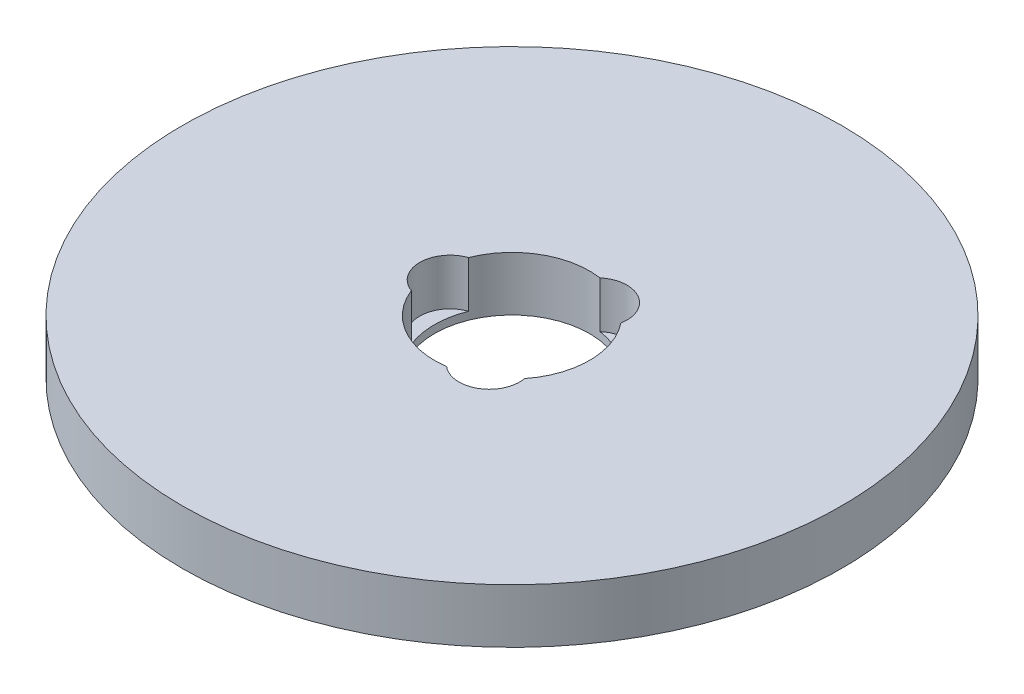
ISO-10303-21;
HEADER;
FILE_DESCRIPTION(('STEP AP214'),'2;1');
FILE_NAME('part.step','',(''),(''),'','','');
FILE_SCHEMA(('AUTOMOTIVE_DESIGN { 1 0 10303 214 1 1 1 1 }'));
ENDSEC;
DATA;
#1=APPLICATION_CONTEXT('core data for automotive mechanical design processes');
#2=APPLICATION_PROTOCOL_DEFINITION('international standard','automotive_design',2000,#1);
#3=PRODUCT_CONTEXT('',#1,'mechanical');
#4=PRODUCT('Part','Part','',(#3));
#5=PRODUCT_RELATED_PRODUCT_CATEGORY('part','',(#4));
#6=PRODUCT_DEFINITION_FORMATION('','',#4);
#7=PRODUCT_DEFINITION_CONTEXT('part definition',#1,'design');
#8=PRODUCT_DEFINITION('design','',#6,#7);
#9=PRODUCT_DEFINITION_SHAPE('','',#8);
#10=(LENGTH_UNIT() NAMED_UNIT(*) SI_UNIT(.MILLI.,.METRE.));
#11=(NAMED_UNIT(*) PLANE_ANGLE_UNIT() SI_UNIT($,.RADIAN.));
#12=(NAMED_UNIT(*) SI_UNIT($,.STERADIAN.) SOLID_ANGLE_UNIT());
#13=UNCERTAINTY_MEASURE_WITH_UNIT(LENGTH_MEASURE(1.E-05),#10,'distance_accuracy_value','');
#14=(GEOMETRIC_REPRESENTATION_CONTEXT(3) GLOBAL_UNCERTAINTY_ASSIGNED_CONTEXT((#13)) GLOBAL_UNIT_ASSIGNED_CONTEXT((#10,
#11,#12)) REPRESENTATION_CONTEXT('',''));
#15=CARTESIAN_POINT('',(0.,0.,0.));
#16=DIRECTION('',(0.,0.,1.));
#17=DIRECTION('',(1.,0.,0.));
#18=AXIS2_PLACEMENT_3D('',#15,#16,#17);
#19=CARTESIAN_POINT('',(0.,7.,0.));
#20=DIRECTION('',(0.,-1.,0.));
#21=DIRECTION('',(0.,0.,-1.));
#22=AXIS2_PLACEMENT_3D('',#19,#20,#21);
#23=CYLINDRICAL_SURFACE('',#22,42.5);
#24=CARTESIAN_POINT('',(0.,7.,0.));
#25=DIRECTION('',(0.,1.,0.));
#26=DIRECTION('',(0.,0.,1.));
#27=AXIS2_PLACEMENT_3D('',#24,#25,#26);
#28=CIRCLE('',#27,42.5);
#29=CARTESIAN_POINT('',(0.,7.,42.5));
#30=VERTEX_POINT('',#29);
#31=EDGE_CURVE('E130',#30,#30,#28,.T.);
#32=ORIENTED_EDGE('',*,*,#31,.F.);
#33=EDGE_LOOP('',(#32));
#34=FACE_BOUND('',#33,.T.);
#35=CARTESIAN_POINT('',(0.,0.,0.));
#36=DIRECTION('',(0.,1.,0.));
#37=DIRECTION('',(0.,0.,1.));
#38=AXIS2_PLACEMENT_3D('',#35,#36,#37);
#39=CIRCLE('',#38,42.5);
#40=CARTESIAN_POINT('',(0.,0.,42.5));
#41=VERTEX_POINT('',#40);
#42=EDGE_CURVE('E117',#41,#41,#39,.T.);
#43=ORIENTED_EDGE('',*,*,#42,.T.);
#44=EDGE_LOOP('',(#43));
#45=FACE_BOUND('',#44,.T.);
#46=ADVANCED_FACE('F39',(#34,#45),#23,.T.);
#47=CARTESIAN_POINT('',(0.,7.,0.));
#48=DIRECTION('',(0.,1.,0.));
#49=DIRECTION('',(0.,0.,1.));
#50=AXIS2_PLACEMENT_3D('',#47,#48,#49);
#51=PLANE('',#50);
#52=CARTESIAN_POINT('',(3.99436601122093,7.,6.9184448754608));
#53=DIRECTION('',(0.,1.,0.));
#54=DIRECTION('',(0.866025403784436,0.,-0.500000000000004));
#55=AXIS2_PLACEMENT_3D('',#52,#53,#54);
#56=CIRCLE('',#55,3.91149778572883);
#57=CARTESIAN_POINT('',(1.4550014765448,7.,9.89358229880625));
#58=VERTEX_POINT('',#57);
#59=CARTESIAN_POINT('',(7.84059286692592,7.,6.20685939063472));
#60=VERTEX_POINT('',#59);
#61=EDGE_CURVE('E148',#58,#60,#56,.T.);
#62=ORIENTED_EDGE('',*,*,#61,.F.);
#63=CARTESIAN_POINT('',(0.,7.,0.));
#64=DIRECTION('',(0.,1.,0.));
#65=DIRECTION('',(0.,0.,1.));
#66=AXIS2_PLACEMENT_3D('',#63,#64,#65);
#67=CIRCLE('',#66,10.);
#68=CARTESIAN_POINT('',(-9.29559434347064,7.,3.68672290817151));
#69=VERTEX_POINT('',#68);
#70=EDGE_CURVE('E113',#69,#58,#67,.T.);
#71=ORIENTED_EDGE('',*,*,#70,.F.);
#72=CARTESIAN_POINT('',(-7.98873202244179,7.,0.));
#73=DIRECTION('',(0.,1.,0.));
#74=DIRECTION('',(0.,0.,1.));
#75=AXIS2_PLACEMENT_3D('',#72,#73,#74);
#76=CIRCLE('',#75,3.91149778572883);
#77=CARTESIAN_POINT('',(-9.29559434347064,7.,-3.68672290817151));
#78=VERTEX_POINT('',#77);
#79=EDGE_CURVE('E125',#78,#69,#76,.T.);
#80=ORIENTED_EDGE('',*,*,#79,.F.);
#81=CARTESIAN_POINT('',(1.45500147654466,7.,-9.89358229880627));
#82=VERTEX_POINT('',#81);
#83=EDGE_CURVE('E107',#82,#78,#67,.T.);
#84=ORIENTED_EDGE('',*,*,#83,.F.);
#85=CARTESIAN_POINT('',(3.99436601122083,7.,-6.91844487546086));
#86=DIRECTION('',(0.,1.,0.));
#87=DIRECTION('',(-0.866025403784443,0.,-0.499999999999992));
#88=AXIS2_PLACEMENT_3D('',#85,#86,#87);
#89=CIRCLE('',#88,3.91149778572883);
#90=CARTESIAN_POINT('',(7.84059286692584,7.,-6.20685939063482));
#91=VERTEX_POINT('',#90);
#92=EDGE_CURVE('E95',#91,#82,#89,.T.);
#93=ORIENTED_EDGE('',*,*,#92,.F.);
#94=EDGE_CURVE('E106',#60,#91,#67,.T.);
#95=ORIENTED_EDGE('',*,*,#94,.F.);
#96=EDGE_LOOP('',(#62,#71,#80,#84,#93,#95));
#97=FACE_BOUND('',#96,.T.);
#98=ORIENTED_EDGE('',*,*,#31,.T.);
#99=EDGE_LOOP('',(#98));
#100=FACE_BOUND('',#99,.T.);
#101=ADVANCED_FACE('F102',(#97,#100),#51,.T.);
#102=CARTESIAN_POINT('',(0.,0.,0.));
#103=DIRECTION('',(0.,1.,0.));
#104=DIRECTION('',(0.,0.,1.));
#105=AXIS2_PLACEMENT_3D('',#102,#103,#104);
#106=PLANE('',#105);
#107=CARTESIAN_POINT('',(0.,0.,0.));
#108=DIRECTION('',(0.,1.,0.));
#109=DIRECTION('',(0.,0.,1.));
#110=AXIS2_PLACEMENT_3D('',#107,#108,#109);
#111=CIRCLE('',#110,10.);
#112=CARTESIAN_POINT('',(0.,0.,10.));
#113=VERTEX_POINT('',#112);
#114=EDGE_CURVE('E118',#113,#113,#111,.T.);
#115=ORIENTED_EDGE('',*,*,#114,.T.);
#116=EDGE_LOOP('',(#115));
#117=FACE_BOUND('',#116,.T.);
#118=ORIENTED_EDGE('',*,*,#42,.F.);
#119=EDGE_LOOP('',(#118));
#120=FACE_BOUND('',#119,.T.);
#121=ADVANCED_FACE('F161',(#117,#120),#106,.F.);
#122=CARTESIAN_POINT('',(0.,7.,0.));
#123=DIRECTION('',(0.,-1.,0.));
#124=DIRECTION('',(0.,0.,-1.));
#125=AXIS2_PLACEMENT_3D('',#122,#123,#124);
#126=CYLINDRICAL_SURFACE('',#125,10.);
#127=DIRECTION('',(0.,1.,0.));
#128=VECTOR('',#127,1.);
#129=CARTESIAN_POINT('',(1.45500147654479,3.99949182205751,9.89358229880625));
#130=LINE('',#129,#128);
#131=CARTESIAN_POINT('',(1.4550014765448,0.998983644115012,9.89358229880625));
#132=VERTEX_POINT('',#131);
#133=EDGE_CURVE('E11',#132,#58,#130,.T.);
#134=ORIENTED_EDGE('',*,*,#133,.F.);
#135=CARTESIAN_POINT('',(0.,0.998983644115012,0.));
#136=DIRECTION('',(0.,1.,0.));
#137=DIRECTION('',(0.,0.,1.));
#138=AXIS2_PLACEMENT_3D('',#135,#136,#137);
#139=CIRCLE('',#138,10.);
#140=CARTESIAN_POINT('',(7.84059286692592,0.998983644115012,6.20685939063472));
#141=VERTEX_POINT('',#140);
#142=EDGE_CURVE('E100',#132,#141,#139,.T.);
#143=ORIENTED_EDGE('',*,*,#142,.T.);
#144=DIRECTION('',(0.,1.,0.));
#145=VECTOR('',#144,1.);
#146=CARTESIAN_POINT('',(7.84059286692592,3.99949182205751,6.20685939063471));
#147=LINE('',#146,#145);
#148=EDGE_CURVE('E46',#60,#141,#147,.F.);
#149=ORIENTED_EDGE('',*,*,#148,.F.);
#150=ORIENTED_EDGE('',*,*,#94,.T.);
#151=DIRECTION('',(0.,1.,0.));
#152=VECTOR('',#151,1.);
#153=CARTESIAN_POINT('',(7.84059286692583,3.99949182205751,-6.20685939063482));
#154=LINE('',#153,#152);
#155=CARTESIAN_POINT('',(7.84059286692584,0.998983644115012,-6.20685939063482));
#156=VERTEX_POINT('',#155);
#157=EDGE_CURVE('E90',#156,#91,#154,.T.);
#158=ORIENTED_EDGE('',*,*,#157,.F.);
#159=CARTESIAN_POINT('',(0.,0.998983644115012,0.));
#160=DIRECTION('',(0.,1.,0.));
#161=DIRECTION('',(0.,0.,1.));
#162=AXIS2_PLACEMENT_3D('',#159,#160,#161);
#163=CIRCLE('',#162,10.);
#164=CARTESIAN_POINT('',(1.45500147654466,0.998983644115012,-9.89358229880627));
#165=VERTEX_POINT('',#164);
#166=EDGE_CURVE('E143',#156,#165,#163,.T.);
#167=ORIENTED_EDGE('',*,*,#166,.T.);
#168=DIRECTION('',(0.,1.,0.));
#169=VECTOR('',#168,1.);
#170=CARTESIAN_POINT('',(1.45500147654466,3.99949182205751,-9.89358229880627));
#171=LINE('',#170,#169);
#172=EDGE_CURVE('E98',#82,#165,#171,.F.);
#173=ORIENTED_EDGE('',*,*,#172,.F.);
#174=ORIENTED_EDGE('',*,*,#83,.T.);
#175=DIRECTION('',(0.,1.,0.));
#176=VECTOR('',#175,1.);
#177=CARTESIAN_POINT('',(-9.29559434347064,3.99949182205751,-3.68672290817151));
#178=LINE('',#177,#176);
#179=CARTESIAN_POINT('',(-9.29559434347064,0.998983644115012,-3.68672290817151));
#180=VERTEX_POINT('',#179);
#181=EDGE_CURVE('E137',#180,#78,#178,.T.);
#182=ORIENTED_EDGE('',*,*,#181,.F.);
#183=CARTESIAN_POINT('',(0.,0.998983644115012,0.));
#184=DIRECTION('',(0.,1.,0.));
#185=DIRECTION('',(0.,0.,1.));
#186=AXIS2_PLACEMENT_3D('',#183,#184,#185);
#187=CIRCLE('',#186,10.);
#188=CARTESIAN_POINT('',(-9.29559434347064,0.998983644115012,3.68672290817151));
#189=VERTEX_POINT('',#188);
#190=EDGE_CURVE('E128',#180,#189,#187,.T.);
#191=ORIENTED_EDGE('',*,*,#190,.T.);
#192=DIRECTION('',(0.,1.,0.));
#193=VECTOR('',#192,1.);
#194=CARTESIAN_POINT('',(-9.29559434347064,3.99949182205751,3.68672290817151));
#195=LINE('',#194,#193);
#196=EDGE_CURVE('E134',#69,#189,#195,.F.);
#197=ORIENTED_EDGE('',*,*,#196,.F.);
#198=ORIENTED_EDGE('',*,*,#70,.T.);
#199=EDGE_LOOP('',(#134,#143,#149,#150,#158,#167,#173,#174,#182,#191,#197,#198));
#200=FACE_BOUND('',#199,.T.);
#201=ORIENTED_EDGE('',*,*,#114,.F.);
#202=EDGE_LOOP('',(#201));
#203=FACE_BOUND('',#202,.T.);
#204=ADVANCED_FACE('F115',(#200,#203),#126,.F.);
#205=CARTESIAN_POINT('',(-7.98873202244179,0.998983644115012,0.));
#206=DIRECTION('',(0.,1.,0.));
#207=DIRECTION('',(0.,0.,1.));
#208=AXIS2_PLACEMENT_3D('',#205,#206,#207);
#209=CYLINDRICAL_SURFACE('',#208,3.91149778572883);
#210=ORIENTED_EDGE('',*,*,#181,.T.);
#211=ORIENTED_EDGE('',*,*,#79,.T.);
#212=ORIENTED_EDGE('',*,*,#196,.T.);
#213=CARTESIAN_POINT('',(-7.98873202244179,0.998983644115012,0.));
#214=DIRECTION('',(0.,1.,0.));
#215=DIRECTION('',(0.,0.,1.));
#216=AXIS2_PLACEMENT_3D('',#213,#214,#215);
#217=CIRCLE('',#216,3.91149778572883);
#218=EDGE_CURVE('E127',#180,#189,#217,.T.);
#219=ORIENTED_EDGE('',*,*,#218,.F.);
#220=EDGE_LOOP('',(#210,#211,#212,#219));
#221=FACE_BOUND('',#220,.T.);
#222=ADVANCED_FACE('F175',(#221),#209,.F.);
#223=CARTESIAN_POINT('',(-7.98873202244179,0.998983644115012,0.));
#224=DIRECTION('',(0.,1.,0.));
#225=DIRECTION('',(0.,0.,1.));
#226=AXIS2_PLACEMENT_3D('',#223,#224,#225);
#227=PLANE('',#226);
#228=ORIENTED_EDGE('',*,*,#218,.T.);
#229=ORIENTED_EDGE('',*,*,#190,.F.);
#230=EDGE_LOOP('',(#228,#229));
#231=FACE_BOUND('',#230,.T.);
#232=ADVANCED_FACE('F176',(#231),#227,.T.);
#233=CARTESIAN_POINT('',(3.99436601122083,0.998983644115012,-6.91844487546086));
#234=DIRECTION('',(0.,1.,0.));
#235=DIRECTION('',(0.,0.,1.));
#236=AXIS2_PLACEMENT_3D('',#233,#234,#235);
#237=CYLINDRICAL_SURFACE('',#236,3.91149778572883);
#238=ORIENTED_EDGE('',*,*,#157,.T.);
#239=ORIENTED_EDGE('',*,*,#92,.T.);
#240=ORIENTED_EDGE('',*,*,#172,.T.);
#241=CARTESIAN_POINT('',(3.99436601122083,0.998983644115012,-6.91844487546086));
#242=DIRECTION('',(0.,1.,0.));
#243=DIRECTION('',(-0.866025403784443,0.,-0.499999999999992));
#244=AXIS2_PLACEMENT_3D('',#241,#242,#243);
#245=CIRCLE('',#244,3.91149778572883);
#246=EDGE_CURVE('E56',#156,#165,#245,.T.);
#247=ORIENTED_EDGE('',*,*,#246,.F.);
#248=EDGE_LOOP('',(#238,#239,#240,#247));
#249=FACE_BOUND('',#248,.T.);
#250=ADVANCED_FACE('F93',(#249),#237,.F.);
#251=CARTESIAN_POINT('',(3.99436601122083,0.998983644115012,-6.91844487546086));
#252=DIRECTION('',(0.,1.,0.));
#253=DIRECTION('',(-0.866025403784443,0.,-0.499999999999992));
#254=AXIS2_PLACEMENT_3D('',#251,#252,#253);
#255=PLANE('',#254);
#256=ORIENTED_EDGE('',*,*,#246,.T.);
#257=ORIENTED_EDGE('',*,*,#166,.F.);
#258=EDGE_LOOP('',(#256,#257));
#259=FACE_BOUND('',#258,.T.);
#260=ADVANCED_FACE('F153',(#259),#255,.T.);
#261=CARTESIAN_POINT('',(3.99436601122093,0.998983644115012,6.9184448754608));
#262=DIRECTION('',(0.,1.,0.));
#263=DIRECTION('',(0.,0.,1.));
#264=AXIS2_PLACEMENT_3D('',#261,#262,#263);
#265=CYLINDRICAL_SURFACE('',#264,3.91149778572883);
#266=ORIENTED_EDGE('',*,*,#133,.T.);
#267=ORIENTED_EDGE('',*,*,#61,.T.);
#268=ORIENTED_EDGE('',*,*,#148,.T.);
#269=CARTESIAN_POINT('',(3.99436601122093,0.998983644115012,6.9184448754608));
#270=DIRECTION('',(0.,1.,0.));
#271=DIRECTION('',(0.866025403784436,0.,-0.500000000000004));
#272=AXIS2_PLACEMENT_3D('',#269,#270,#271);
#273=CIRCLE('',#272,3.91149778572883);
#274=EDGE_CURVE('E55',#132,#141,#273,.T.);
#275=ORIENTED_EDGE('',*,*,#274,.F.);
#276=EDGE_LOOP('',(#266,#267,#268,#275));
#277=FACE_BOUND('',#276,.T.);
#278=ADVANCED_FACE('F144',(#277),#265,.F.);
#279=CARTESIAN_POINT('',(3.99436601122093,0.998983644115012,6.9184448754608));
#280=DIRECTION('',(0.,1.,0.));
#281=DIRECTION('',(0.866025403784436,0.,-0.500000000000004));
#282=AXIS2_PLACEMENT_3D('',#279,#280,#281);
#283=PLANE('',#282);
#284=ORIENTED_EDGE('',*,*,#274,.T.);
#285=ORIENTED_EDGE('',*,*,#142,.F.);
#286=EDGE_LOOP('',(#284,#285));
#287=FACE_BOUND('',#286,.T.);
#288=ADVANCED_FACE('F150',(#287),#283,.T.);
#289=CLOSED_SHELL('',(#46,#101,#121,#204,#222,#232,#250,#260,#278,#288));
#290=MANIFOLD_SOLID_BREP('B2',#289);
#291=ADVANCED_BREP_SHAPE_REPRESENTATION('',(#18,#290),#14);
#292=SHAPE_DEFINITION_REPRESENTATION(#9,#291);
ENDSEC;
END-ISO-10303-21;
